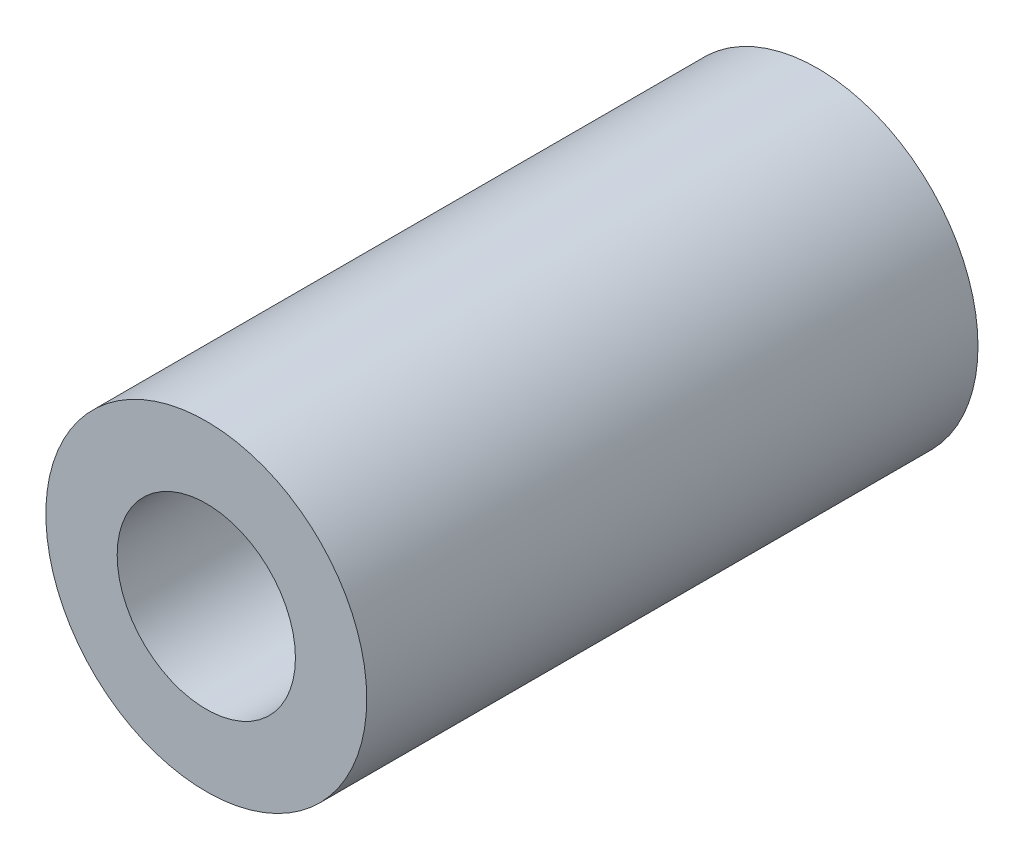
ISO-10303-21;
HEADER;
FILE_DESCRIPTION(('STEP AP214'),'2;1');
FILE_NAME('part.step','',(''),(''),'','','');
FILE_SCHEMA(('AUTOMOTIVE_DESIGN { 1 0 10303 214 1 1 1 1 }'));
ENDSEC;
DATA;
#1=APPLICATION_CONTEXT('core data for automotive mechanical design processes');
#2=APPLICATION_PROTOCOL_DEFINITION('international standard','automotive_design',2000,#1);
#3=PRODUCT_CONTEXT('',#1,'mechanical');
#4=PRODUCT('Part','Part','',(#3));
#5=PRODUCT_RELATED_PRODUCT_CATEGORY('part','',(#4));
#6=PRODUCT_DEFINITION_FORMATION('','',#4);
#7=PRODUCT_DEFINITION_CONTEXT('part definition',#1,'design');
#8=PRODUCT_DEFINITION('design','',#6,#7);
#9=PRODUCT_DEFINITION_SHAPE('','',#8);
#10=(LENGTH_UNIT() NAMED_UNIT(*) SI_UNIT(.MILLI.,.METRE.));
#11=(NAMED_UNIT(*) PLANE_ANGLE_UNIT() SI_UNIT($,.RADIAN.));
#12=(NAMED_UNIT(*) SI_UNIT($,.STERADIAN.) SOLID_ANGLE_UNIT());
#13=UNCERTAINTY_MEASURE_WITH_UNIT(LENGTH_MEASURE(1.E-05),#10,'distance_accuracy_value','');
#14=(GEOMETRIC_REPRESENTATION_CONTEXT(3) GLOBAL_UNCERTAINTY_ASSIGNED_CONTEXT((#13)) GLOBAL_UNIT_ASSIGNED_CONTEXT((#10,
#11,#12)) REPRESENTATION_CONTEXT('',''));
#15=CARTESIAN_POINT('',(0.,0.,0.));
#16=DIRECTION('',(0.,0.,1.));
#17=DIRECTION('',(1.,0.,0.));
#18=AXIS2_PLACEMENT_3D('',#15,#16,#17);
#19=CARTESIAN_POINT('',(0.,0.,12.));
#20=DIRECTION('',(0.,0.,1.));
#21=DIRECTION('',(1.,0.,0.));
#22=AXIS2_PLACEMENT_3D('',#19,#20,#21);
#23=PLANE('',#22);
#24=CARTESIAN_POINT('',(0.,0.,12.));
#25=DIRECTION('',(0.,0.,1.));
#26=DIRECTION('',(1.,0.,0.));
#27=AXIS2_PLACEMENT_3D('',#24,#25,#26);
#28=CIRCLE('',#27,3.15);
#29=CARTESIAN_POINT('',(3.15,0.,12.));
#30=VERTEX_POINT('',#29);
#31=EDGE_CURVE('E12',#30,#30,#28,.T.);
#32=ORIENTED_EDGE('',*,*,#31,.T.);
#33=EDGE_LOOP('',(#32));
#34=FACE_BOUND('',#33,.T.);
#35=CARTESIAN_POINT('',(0.,0.,12.));
#36=DIRECTION('',(0.,0.,1.));
#37=DIRECTION('',(1.,0.,0.));
#38=AXIS2_PLACEMENT_3D('',#35,#36,#37);
#39=CIRCLE('',#38,1.75);
#40=CARTESIAN_POINT('',(1.75,0.,12.));
#41=VERTEX_POINT('',#40);
#42=EDGE_CURVE('E51',#41,#41,#39,.T.);
#43=ORIENTED_EDGE('',*,*,#42,.F.);
#44=EDGE_LOOP('',(#43));
#45=FACE_BOUND('',#44,.T.);
#46=ADVANCED_FACE('F40',(#34,#45),#23,.T.);
#47=CARTESIAN_POINT('',(0.,0.,0.));
#48=DIRECTION('',(0.,0.,1.));
#49=DIRECTION('',(1.,0.,0.));
#50=AXIS2_PLACEMENT_3D('',#47,#48,#49);
#51=PLANE('',#50);
#52=CARTESIAN_POINT('',(0.,0.,0.));
#53=DIRECTION('',(0.,0.,1.));
#54=DIRECTION('',(1.,0.,0.));
#55=AXIS2_PLACEMENT_3D('',#52,#53,#54);
#56=CIRCLE('',#55,3.15);
#57=CARTESIAN_POINT('',(3.15,0.,0.));
#58=VERTEX_POINT('',#57);
#59=EDGE_CURVE('E44',#58,#58,#56,.T.);
#60=ORIENTED_EDGE('',*,*,#59,.F.);
#61=EDGE_LOOP('',(#60));
#62=FACE_BOUND('',#61,.T.);
#63=CARTESIAN_POINT('',(0.,0.,0.));
#64=DIRECTION('',(0.,0.,1.));
#65=DIRECTION('',(1.,0.,0.));
#66=AXIS2_PLACEMENT_3D('',#63,#64,#65);
#67=CIRCLE('',#66,1.75);
#68=CARTESIAN_POINT('',(1.75,0.,0.));
#69=VERTEX_POINT('',#68);
#70=EDGE_CURVE('E53',#69,#69,#67,.T.);
#71=ORIENTED_EDGE('',*,*,#70,.T.);
#72=EDGE_LOOP('',(#71));
#73=FACE_BOUND('',#72,.T.);
#74=ADVANCED_FACE('F63',(#62,#73),#51,.F.);
#75=CARTESIAN_POINT('',(0.,0.,12.));
#76=DIRECTION('',(0.,0.,-1.));
#77=DIRECTION('',(-1.,0.,0.));
#78=AXIS2_PLACEMENT_3D('',#75,#76,#77);
#79=CYLINDRICAL_SURFACE('',#78,3.15);
#80=ORIENTED_EDGE('',*,*,#31,.F.);
#81=EDGE_LOOP('',(#80));
#82=FACE_BOUND('',#81,.T.);
#83=ORIENTED_EDGE('',*,*,#59,.T.);
#84=EDGE_LOOP('',(#83));
#85=FACE_BOUND('',#84,.T.);
#86=ADVANCED_FACE('F42',(#82,#85),#79,.T.);
#87=CARTESIAN_POINT('',(0.,0.,12.));
#88=DIRECTION('',(0.,0.,-1.));
#89=DIRECTION('',(-1.,0.,0.));
#90=AXIS2_PLACEMENT_3D('',#87,#88,#89);
#91=CYLINDRICAL_SURFACE('',#90,1.75);
#92=ORIENTED_EDGE('',*,*,#42,.T.);
#93=EDGE_LOOP('',(#92));
#94=FACE_BOUND('',#93,.T.);
#95=ORIENTED_EDGE('',*,*,#70,.F.);
#96=EDGE_LOOP('',(#95));
#97=FACE_BOUND('',#96,.T.);
#98=ADVANCED_FACE('F59',(#94,#97),#91,.F.);
#99=CLOSED_SHELL('',(#46,#74,#86,#98));
#100=MANIFOLD_SOLID_BREP('B2',#99);
#101=ADVANCED_BREP_SHAPE_REPRESENTATION('',(#18,#100),#14);
#102=SHAPE_DEFINITION_REPRESENTATION(#9,#101);
ENDSEC;
END-ISO-10303-21;
